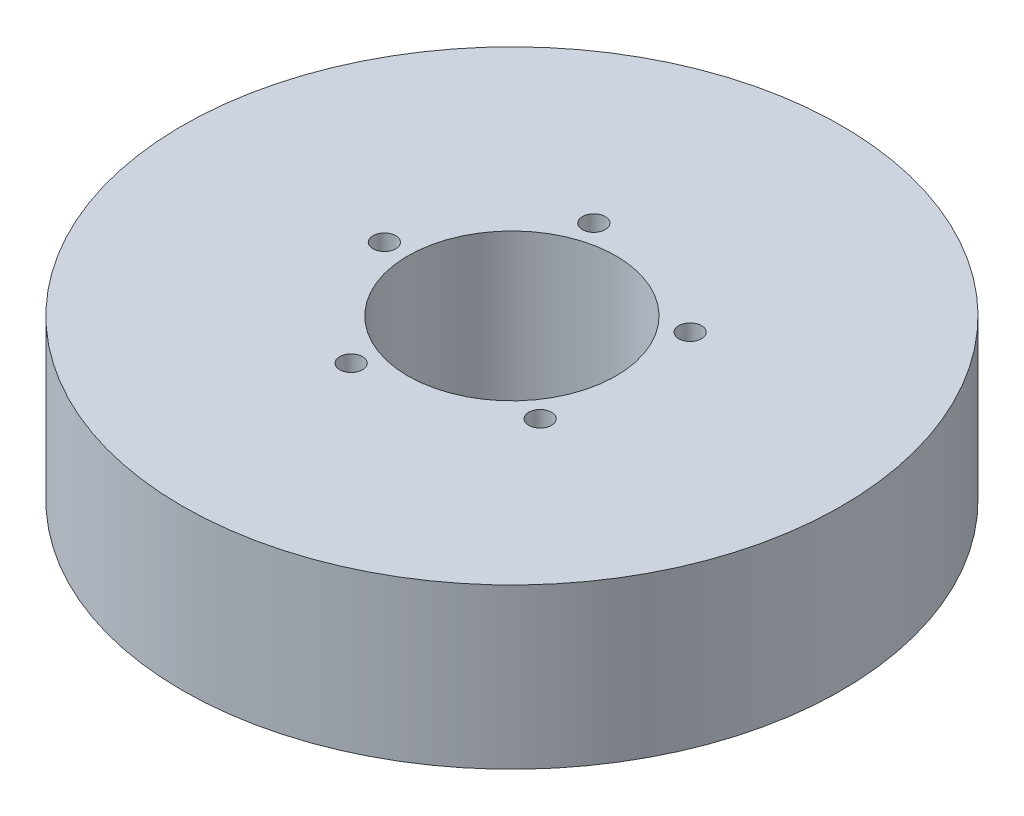
ISO-10303-21;
HEADER;
FILE_DESCRIPTION(('STEP AP214'),'2;1');
FILE_NAME('part.step','',(''),(''),'','','');
FILE_SCHEMA(('AUTOMOTIVE_DESIGN { 1 0 10303 214 1 1 1 1 }'));
ENDSEC;
DATA;
#1=APPLICATION_CONTEXT('core data for automotive mechanical design processes');
#2=APPLICATION_PROTOCOL_DEFINITION('international standard','automotive_design',2000,#1);
#3=PRODUCT_CONTEXT('',#1,'mechanical');
#4=PRODUCT('Part','Part','',(#3));
#5=PRODUCT_RELATED_PRODUCT_CATEGORY('part','',(#4));
#6=PRODUCT_DEFINITION_FORMATION('','',#4);
#7=PRODUCT_DEFINITION_CONTEXT('part definition',#1,'design');
#8=PRODUCT_DEFINITION('design','',#6,#7);
#9=PRODUCT_DEFINITION_SHAPE('','',#8);
#10=(LENGTH_UNIT() NAMED_UNIT(*) SI_UNIT(.MILLI.,.METRE.));
#11=(NAMED_UNIT(*) PLANE_ANGLE_UNIT() SI_UNIT($,.RADIAN.));
#12=(NAMED_UNIT(*) SI_UNIT($,.STERADIAN.) SOLID_ANGLE_UNIT());
#13=UNCERTAINTY_MEASURE_WITH_UNIT(LENGTH_MEASURE(1.E-05),#10,'distance_accuracy_value','');
#14=(GEOMETRIC_REPRESENTATION_CONTEXT(3) GLOBAL_UNCERTAINTY_ASSIGNED_CONTEXT((#13)) GLOBAL_UNIT_ASSIGNED_CONTEXT((#10,
#11,#12)) REPRESENTATION_CONTEXT('',''));
#15=CARTESIAN_POINT('',(0.,0.,0.));
#16=DIRECTION('',(0.,0.,1.));
#17=DIRECTION('',(1.,0.,0.));
#18=AXIS2_PLACEMENT_3D('',#15,#16,#17);
#19=CARTESIAN_POINT('',(0.,23.,0.));
#20=DIRECTION('',(0.,-1.,0.));
#21=DIRECTION('',(0.,0.,-1.));
#22=AXIS2_PLACEMENT_3D('',#19,#20,#21);
#23=CYLINDRICAL_SURFACE('',#22,47.5);
#24=CARTESIAN_POINT('',(0.,23.,0.));
#25=DIRECTION('',(0.,1.,0.));
#26=DIRECTION('',(0.,0.,1.));
#27=AXIS2_PLACEMENT_3D('',#24,#25,#26);
#28=CIRCLE('',#27,47.5);
#29=CARTESIAN_POINT('',(0.,23.,47.5));
#30=VERTEX_POINT('',#29);
#31=EDGE_CURVE('E10',#30,#30,#28,.T.);
#32=ORIENTED_EDGE('',*,*,#31,.F.);
#33=EDGE_LOOP('',(#32));
#34=FACE_BOUND('',#33,.T.);
#35=CARTESIAN_POINT('',(0.,0.,0.));
#36=DIRECTION('',(0.,1.,0.));
#37=DIRECTION('',(0.,0.,1.));
#38=AXIS2_PLACEMENT_3D('',#35,#36,#37);
#39=CIRCLE('',#38,47.5);
#40=CARTESIAN_POINT('',(0.,0.,47.5));
#41=VERTEX_POINT('',#40);
#42=EDGE_CURVE('E37',#41,#41,#39,.T.);
#43=ORIENTED_EDGE('',*,*,#42,.T.);
#44=EDGE_LOOP('',(#43));
#45=FACE_BOUND('',#44,.T.);
#46=ADVANCED_FACE('F40',(#34,#45),#23,.T.);
#47=CARTESIAN_POINT('',(0.,23.,0.));
#48=DIRECTION('',(0.,1.,0.));
#49=DIRECTION('',(0.,0.,1.));
#50=AXIS2_PLACEMENT_3D('',#47,#48,#49);
#51=PLANE('',#50);
#52=CARTESIAN_POINT('',(-5.68252828132631,23.,17.489023740971));
#53=DIRECTION('',(0.,1.,0.));
#54=DIRECTION('',(0.951056516295155,0.,0.309016994374945));
#55=AXIS2_PLACEMENT_3D('',#52,#53,#54);
#56=CIRCLE('',#55,1.64327736890487);
#57=CARTESIAN_POINT('',(-4.11967863154899,23.,17.9968243744343));
#58=VERTEX_POINT('',#57);
#59=EDGE_CURVE('E78',#58,#58,#56,.T.);
#60=ORIENTED_EDGE('',*,*,#59,.F.);
#61=EDGE_LOOP('',(#60));
#62=FACE_BOUND('',#61,.T.);
#63=CARTESIAN_POINT('',(14.877052182545,23.,10.8088111019738));
#64=DIRECTION('',(0.,1.,0.));
#65=DIRECTION('',(0.587785252292469,0.,-0.809016994374951));
#66=AXIS2_PLACEMENT_3D('',#63,#64,#65);
#67=CIRCLE('',#66,1.64327736890487);
#68=CARTESIAN_POINT('',(15.8429463854133,23.,9.479371784058));
#69=VERTEX_POINT('',#68);
#70=EDGE_CURVE('E71',#69,#69,#67,.T.);
#71=ORIENTED_EDGE('',*,*,#70,.F.);
#72=EDGE_LOOP('',(#71));
#73=FACE_BOUND('',#72,.T.);
#74=CARTESIAN_POINT('',(14.8770521825448,23.,-10.808811101974));
#75=DIRECTION('',(0.,1.,0.));
#76=DIRECTION('',(-0.58778525229248,0.,-0.809016994374942));
#77=AXIS2_PLACEMENT_3D('',#74,#75,#76);
#78=CIRCLE('',#77,1.64327736890487);
#79=CARTESIAN_POINT('',(13.9111579796766,23.,-12.1382504198898));
#80=VERTEX_POINT('',#79);
#81=EDGE_CURVE('E70',#80,#80,#78,.T.);
#82=ORIENTED_EDGE('',*,*,#81,.F.);
#83=EDGE_LOOP('',(#82));
#84=FACE_BOUND('',#83,.T.);
#85=CARTESIAN_POINT('',(-5.68252828132656,23.,-17.4890237409709));
#86=DIRECTION('',(0.,1.,0.));
#87=DIRECTION('',(-0.95105651629515,0.,0.309016994374958));
#88=AXIS2_PLACEMENT_3D('',#85,#86,#87);
#89=CIRCLE('',#88,1.64327736890487);
#90=CARTESIAN_POINT('',(-7.24537793110388,23.,-16.9812231075075));
#91=VERTEX_POINT('',#90);
#92=EDGE_CURVE('E61',#91,#91,#89,.T.);
#93=ORIENTED_EDGE('',*,*,#92,.F.);
#94=EDGE_LOOP('',(#93));
#95=FACE_BOUND('',#94,.T.);
#96=CARTESIAN_POINT('',(-18.3890478024372,23.,0.));
#97=DIRECTION('',(0.,1.,0.));
#98=DIRECTION('',(0.,0.,1.));
#99=AXIS2_PLACEMENT_3D('',#96,#97,#98);
#100=CIRCLE('',#99,1.64327736890487);
#101=CARTESIAN_POINT('',(-18.3890478024372,23.,1.64327736890487));
#102=VERTEX_POINT('',#101);
#103=EDGE_CURVE('E54',#102,#102,#100,.T.);
#104=ORIENTED_EDGE('',*,*,#103,.F.);
#105=EDGE_LOOP('',(#104));
#106=FACE_BOUND('',#105,.T.);
#107=CARTESIAN_POINT('',(0.,23.,0.));
#108=DIRECTION('',(0.,1.,0.));
#109=DIRECTION('',(0.,0.,1.));
#110=AXIS2_PLACEMENT_3D('',#107,#108,#109);
#111=CIRCLE('',#110,15.);
#112=CARTESIAN_POINT('',(0.,23.,15.));
#113=VERTEX_POINT('',#112);
#114=EDGE_CURVE('E50',#113,#113,#111,.T.);
#115=ORIENTED_EDGE('',*,*,#114,.F.);
#116=EDGE_LOOP('',(#115));
#117=FACE_BOUND('',#116,.T.);
#118=ORIENTED_EDGE('',*,*,#31,.T.);
#119=EDGE_LOOP('',(#118));
#120=FACE_BOUND('',#119,.T.);
#121=ADVANCED_FACE('F94',(#62,#73,#84,#95,#106,#117,#120),#51,.T.);
#122=CARTESIAN_POINT('',(0.,0.,0.));
#123=DIRECTION('',(0.,1.,0.));
#124=DIRECTION('',(0.,0.,1.));
#125=AXIS2_PLACEMENT_3D('',#122,#123,#124);
#126=PLANE('',#125);
#127=CARTESIAN_POINT('',(0.,0.,0.));
#128=DIRECTION('',(0.,1.,0.));
#129=DIRECTION('',(0.,0.,1.));
#130=AXIS2_PLACEMENT_3D('',#127,#128,#129);
#131=CIRCLE('',#130,15.);
#132=CARTESIAN_POINT('',(0.,0.,15.));
#133=VERTEX_POINT('',#132);
#134=EDGE_CURVE('E47',#133,#133,#131,.T.);
#135=ORIENTED_EDGE('',*,*,#134,.T.);
#136=EDGE_LOOP('',(#135));
#137=FACE_BOUND('',#136,.T.);
#138=ORIENTED_EDGE('',*,*,#42,.F.);
#139=EDGE_LOOP('',(#138));
#140=FACE_BOUND('',#139,.T.);
#141=ADVANCED_FACE('F100',(#137,#140),#126,.F.);
#142=CARTESIAN_POINT('',(0.,23.,0.));
#143=DIRECTION('',(0.,-1.,0.));
#144=DIRECTION('',(0.,0.,-1.));
#145=AXIS2_PLACEMENT_3D('',#142,#143,#144);
#146=CYLINDRICAL_SURFACE('',#145,15.);
#147=ORIENTED_EDGE('',*,*,#114,.T.);
#148=EDGE_LOOP('',(#147));
#149=FACE_BOUND('',#148,.T.);
#150=ORIENTED_EDGE('',*,*,#134,.F.);
#151=EDGE_LOOP('',(#150));
#152=FACE_BOUND('',#151,.T.);
#153=ADVANCED_FACE('F108',(#149,#152),#146,.F.);
#154=CARTESIAN_POINT('',(-18.3890478024372,3.00188601809114,0.));
#155=DIRECTION('',(0.,1.,0.));
#156=DIRECTION('',(0.,0.,1.));
#157=AXIS2_PLACEMENT_3D('',#154,#155,#156);
#158=CYLINDRICAL_SURFACE('',#157,1.64327736890487);
#159=CARTESIAN_POINT('',(-18.3890478024372,3.00188601809114,0.));
#160=DIRECTION('',(0.,1.,0.));
#161=DIRECTION('',(0.,0.,1.));
#162=AXIS2_PLACEMENT_3D('',#159,#160,#161);
#163=CIRCLE('',#162,1.64327736890487);
#164=CARTESIAN_POINT('',(-18.3890478024372,3.00188601809114,1.64327736890487));
#165=VERTEX_POINT('',#164);
#166=EDGE_CURVE('E55',#165,#165,#163,.T.);
#167=ORIENTED_EDGE('',*,*,#166,.F.);
#168=EDGE_LOOP('',(#167));
#169=FACE_BOUND('',#168,.T.);
#170=ORIENTED_EDGE('',*,*,#103,.T.);
#171=EDGE_LOOP('',(#170));
#172=FACE_BOUND('',#171,.T.);
#173=ADVANCED_FACE('F115',(#169,#172),#158,.F.);
#174=CARTESIAN_POINT('',(-18.3890478024372,3.00188601809114,0.));
#175=DIRECTION('',(0.,1.,0.));
#176=DIRECTION('',(0.,0.,1.));
#177=AXIS2_PLACEMENT_3D('',#174,#175,#176);
#178=PLANE('',#177);
#179=ORIENTED_EDGE('',*,*,#166,.T.);
#180=EDGE_LOOP('',(#179));
#181=FACE_BOUND('',#180,.T.);
#182=ADVANCED_FACE('F142',(#181),#178,.T.);
#183=CARTESIAN_POINT('',(-5.68252828132656,3.00188601809114,-17.4890237409709));
#184=DIRECTION('',(0.,1.,0.));
#185=DIRECTION('',(0.,0.,1.));
#186=AXIS2_PLACEMENT_3D('',#183,#184,#185);
#187=CYLINDRICAL_SURFACE('',#186,1.64327736890487);
#188=CARTESIAN_POINT('',(-5.68252828132656,3.00188601809114,-17.4890237409709));
#189=DIRECTION('',(0.,1.,0.));
#190=DIRECTION('',(-0.95105651629515,0.,0.309016994374958));
#191=AXIS2_PLACEMENT_3D('',#188,#189,#190);
#192=CIRCLE('',#191,1.64327736890487);
#193=CARTESIAN_POINT('',(-7.24537793110388,3.00188601809114,-16.9812231075075));
#194=VERTEX_POINT('',#193);
#195=EDGE_CURVE('E63',#194,#194,#192,.T.);
#196=ORIENTED_EDGE('',*,*,#195,.F.);
#197=EDGE_LOOP('',(#196));
#198=FACE_BOUND('',#197,.T.);
#199=ORIENTED_EDGE('',*,*,#92,.T.);
#200=EDGE_LOOP('',(#199));
#201=FACE_BOUND('',#200,.T.);
#202=ADVANCED_FACE('F147',(#198,#201),#187,.F.);
#203=CARTESIAN_POINT('',(-5.68252828132656,3.00188601809114,-17.4890237409709));
#204=DIRECTION('',(0.,1.,0.));
#205=DIRECTION('',(-0.95105651629515,0.,0.309016994374958));
#206=AXIS2_PLACEMENT_3D('',#203,#204,#205);
#207=PLANE('',#206);
#208=ORIENTED_EDGE('',*,*,#195,.T.);
#209=EDGE_LOOP('',(#208));
#210=FACE_BOUND('',#209,.T.);
#211=ADVANCED_FACE('F163',(#210),#207,.T.);
#212=CARTESIAN_POINT('',(14.8770521825448,3.00188601809114,-10.808811101974));
#213=DIRECTION('',(0.,1.,0.));
#214=DIRECTION('',(0.,0.,1.));
#215=AXIS2_PLACEMENT_3D('',#212,#213,#214);
#216=CYLINDRICAL_SURFACE('',#215,1.64327736890487);
#217=CARTESIAN_POINT('',(14.8770521825448,3.00188601809114,-10.808811101974));
#218=DIRECTION('',(0.,1.,0.));
#219=DIRECTION('',(-0.58778525229248,0.,-0.809016994374942));
#220=AXIS2_PLACEMENT_3D('',#217,#218,#219);
#221=CIRCLE('',#220,1.64327736890487);
#222=CARTESIAN_POINT('',(13.9111579796766,3.00188601809114,-12.1382504198898));
#223=VERTEX_POINT('',#222);
#224=EDGE_CURVE('E69',#223,#223,#221,.T.);
#225=ORIENTED_EDGE('',*,*,#224,.F.);
#226=EDGE_LOOP('',(#225));
#227=FACE_BOUND('',#226,.T.);
#228=ORIENTED_EDGE('',*,*,#81,.T.);
#229=EDGE_LOOP('',(#228));
#230=FACE_BOUND('',#229,.T.);
#231=ADVANCED_FACE('F172',(#227,#230),#216,.F.);
#232=CARTESIAN_POINT('',(14.8770521825448,3.00188601809114,-10.808811101974));
#233=DIRECTION('',(0.,1.,0.));
#234=DIRECTION('',(-0.58778525229248,0.,-0.809016994374942));
#235=AXIS2_PLACEMENT_3D('',#232,#233,#234);
#236=PLANE('',#235);
#237=ORIENTED_EDGE('',*,*,#224,.T.);
#238=EDGE_LOOP('',(#237));
#239=FACE_BOUND('',#238,.T.);
#240=ADVANCED_FACE('F185',(#239),#236,.T.);
#241=CARTESIAN_POINT('',(14.877052182545,3.00188601809114,10.8088111019738));
#242=DIRECTION('',(0.,1.,0.));
#243=DIRECTION('',(0.,0.,1.));
#244=AXIS2_PLACEMENT_3D('',#241,#242,#243);
#245=CYLINDRICAL_SURFACE('',#244,1.64327736890487);
#246=CARTESIAN_POINT('',(14.877052182545,3.00188601809114,10.8088111019738));
#247=DIRECTION('',(0.,1.,0.));
#248=DIRECTION('',(0.587785252292469,0.,-0.809016994374951));
#249=AXIS2_PLACEMENT_3D('',#246,#247,#248);
#250=CIRCLE('',#249,1.64327736890487);
#251=CARTESIAN_POINT('',(15.8429463854133,3.00188601809114,9.479371784058));
#252=VERTEX_POINT('',#251);
#253=EDGE_CURVE('E76',#252,#252,#250,.T.);
#254=ORIENTED_EDGE('',*,*,#253,.F.);
#255=EDGE_LOOP('',(#254));
#256=FACE_BOUND('',#255,.T.);
#257=ORIENTED_EDGE('',*,*,#70,.T.);
#258=EDGE_LOOP('',(#257));
#259=FACE_BOUND('',#258,.T.);
#260=ADVANCED_FACE('F191',(#256,#259),#245,.F.);
#261=CARTESIAN_POINT('',(14.877052182545,3.00188601809114,10.8088111019738));
#262=DIRECTION('',(0.,1.,0.));
#263=DIRECTION('',(0.587785252292469,0.,-0.809016994374951));
#264=AXIS2_PLACEMENT_3D('',#261,#262,#263);
#265=PLANE('',#264);
#266=ORIENTED_EDGE('',*,*,#253,.T.);
#267=EDGE_LOOP('',(#266));
#268=FACE_BOUND('',#267,.T.);
#269=ADVANCED_FACE('F89',(#268),#265,.T.);
#270=CARTESIAN_POINT('',(-5.68252828132631,3.00188601809114,17.489023740971));
#271=DIRECTION('',(0.,1.,0.));
#272=DIRECTION('',(0.,0.,1.));
#273=AXIS2_PLACEMENT_3D('',#270,#271,#272);
#274=CYLINDRICAL_SURFACE('',#273,1.64327736890487);
#275=CARTESIAN_POINT('',(-5.68252828132631,3.00188601809114,17.489023740971));
#276=DIRECTION('',(0.,1.,0.));
#277=DIRECTION('',(0.951056516295155,0.,0.309016994374945));
#278=AXIS2_PLACEMENT_3D('',#275,#276,#277);
#279=CIRCLE('',#278,1.64327736890487);
#280=CARTESIAN_POINT('',(-4.11967863154899,3.00188601809114,17.9968243744343));
#281=VERTEX_POINT('',#280);
#282=EDGE_CURVE('E59',#281,#281,#279,.T.);
#283=ORIENTED_EDGE('',*,*,#282,.F.);
#284=EDGE_LOOP('',(#283));
#285=FACE_BOUND('',#284,.T.);
#286=ORIENTED_EDGE('',*,*,#59,.T.);
#287=EDGE_LOOP('',(#286));
#288=FACE_BOUND('',#287,.T.);
#289=ADVANCED_FACE('F87',(#285,#288),#274,.F.);
#290=CARTESIAN_POINT('',(-5.68252828132631,3.00188601809114,17.489023740971));
#291=DIRECTION('',(0.,1.,0.));
#292=DIRECTION('',(0.951056516295155,0.,0.309016994374945));
#293=AXIS2_PLACEMENT_3D('',#290,#291,#292);
#294=PLANE('',#293);
#295=ORIENTED_EDGE('',*,*,#282,.T.);
#296=EDGE_LOOP('',(#295));
#297=FACE_BOUND('',#296,.T.);
#298=ADVANCED_FACE('F84',(#297),#294,.T.);
#299=CLOSED_SHELL('',(#46,#121,#141,#153,#173,#182,#202,#211,#231,#240,#260,#269,#289,#298));
#300=MANIFOLD_SOLID_BREP('B2',#299);
#301=ADVANCED_BREP_SHAPE_REPRESENTATION('',(#18,#300),#14);
#302=SHAPE_DEFINITION_REPRESENTATION(#9,#301);
ENDSEC;
END-ISO-10303-21;
